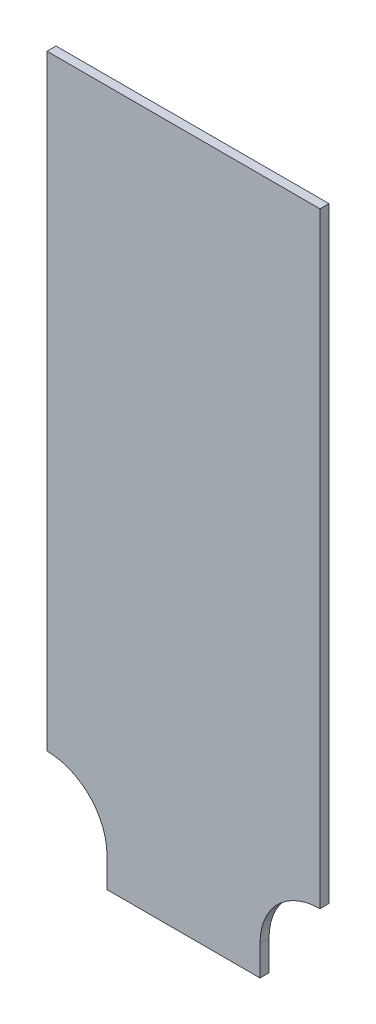
ISO-10303-21;
HEADER;
FILE_DESCRIPTION(('STEP AP214'),'2;1');
FILE_NAME('part.step','',(''),(''),'','','');
FILE_SCHEMA(('AUTOMOTIVE_DESIGN { 1 0 10303 214 1 1 1 1 }'));
ENDSEC;
DATA;
#1=APPLICATION_CONTEXT('core data for automotive mechanical design processes');
#2=APPLICATION_PROTOCOL_DEFINITION('international standard','automotive_design',2000,#1);
#3=PRODUCT_CONTEXT('',#1,'mechanical');
#4=PRODUCT('Part','Part','',(#3));
#5=PRODUCT_RELATED_PRODUCT_CATEGORY('part','',(#4));
#6=PRODUCT_DEFINITION_FORMATION('','',#4);
#7=PRODUCT_DEFINITION_CONTEXT('part definition',#1,'design');
#8=PRODUCT_DEFINITION('design','',#6,#7);
#9=PRODUCT_DEFINITION_SHAPE('','',#8);
#10=(LENGTH_UNIT() NAMED_UNIT(*) SI_UNIT(.MILLI.,.METRE.));
#11=(NAMED_UNIT(*) PLANE_ANGLE_UNIT() SI_UNIT($,.RADIAN.));
#12=(NAMED_UNIT(*) SI_UNIT($,.STERADIAN.) SOLID_ANGLE_UNIT());
#13=UNCERTAINTY_MEASURE_WITH_UNIT(LENGTH_MEASURE(1.E-05),#10,'distance_accuracy_value','');
#14=(GEOMETRIC_REPRESENTATION_CONTEXT(3) GLOBAL_UNCERTAINTY_ASSIGNED_CONTEXT((#13)) GLOBAL_UNIT_ASSIGNED_CONTEXT((#10,
#11,#12)) REPRESENTATION_CONTEXT('',''));
#15=CARTESIAN_POINT('',(0.,0.,0.));
#16=DIRECTION('',(0.,0.,1.));
#17=DIRECTION('',(1.,0.,0.));
#18=AXIS2_PLACEMENT_3D('',#15,#16,#17);
#19=CARTESIAN_POINT('',(-45.5,232.,3.));
#20=DIRECTION('',(1.,0.,0.));
#21=DIRECTION('',(0.,1.,0.));
#22=AXIS2_PLACEMENT_3D('',#19,#20,#21);
#23=PLANE('',#22);
#24=DIRECTION('',(0.,-1.,0.));
#25=VECTOR('',#24,1.);
#26=CARTESIAN_POINT('',(-45.5,232.,0.));
#27=LINE('',#26,#25);
#28=CARTESIAN_POINT('',(-45.5,232.,0.));
#29=VERTEX_POINT('',#28);
#30=CARTESIAN_POINT('',(-45.5,30.,0.));
#31=VERTEX_POINT('',#30);
#32=EDGE_CURVE('E127',#29,#31,#27,.T.);
#33=ORIENTED_EDGE('',*,*,#32,.T.);
#34=DIRECTION('',(0.,0.,-1.));
#35=VECTOR('',#34,1.);
#36=CARTESIAN_POINT('',(-45.5,30.,3.));
#37=LINE('',#36,#35);
#38=CARTESIAN_POINT('',(-45.5,30.,3.));
#39=VERTEX_POINT('',#38);
#40=EDGE_CURVE('E11',#39,#31,#37,.T.);
#41=ORIENTED_EDGE('',*,*,#40,.F.);
#42=DIRECTION('',(0.,-1.,0.));
#43=VECTOR('',#42,1.);
#44=CARTESIAN_POINT('',(-45.5,232.,3.));
#45=LINE('',#44,#43);
#46=CARTESIAN_POINT('',(-45.5,232.,3.));
#47=VERTEX_POINT('',#46);
#48=EDGE_CURVE('E141',#47,#39,#45,.T.);
#49=ORIENTED_EDGE('',*,*,#48,.F.);
#50=DIRECTION('',(0.,0.,-1.));
#51=VECTOR('',#50,1.);
#52=CARTESIAN_POINT('',(-45.5,232.,3.));
#53=LINE('',#52,#51);
#54=EDGE_CURVE('E123',#47,#29,#53,.T.);
#55=ORIENTED_EDGE('',*,*,#54,.T.);
#56=EDGE_LOOP('',(#33,#41,#49,#55));
#57=FACE_BOUND('',#56,.T.);
#58=ADVANCED_FACE('F31',(#57),#23,.F.);
#59=CARTESIAN_POINT('',(-45.5,9.99999999999999,3.));
#60=DIRECTION('',(0.,0.,-1.));
#61=DIRECTION('',(-1.,0.,0.));
#62=AXIS2_PLACEMENT_3D('',#59,#60,#61);
#63=CYLINDRICAL_SURFACE('',#62,20.);
#64=CARTESIAN_POINT('',(-45.5,9.99999999999999,0.));
#65=DIRECTION('',(0.,0.,-1.));
#66=DIRECTION('',(-1.,0.,0.));
#67=AXIS2_PLACEMENT_3D('',#64,#65,#66);
#68=CIRCLE('',#67,20.);
#69=CARTESIAN_POINT('',(-25.5,9.99999999999999,0.));
#70=VERTEX_POINT('',#69);
#71=EDGE_CURVE('E130',#31,#70,#68,.T.);
#72=ORIENTED_EDGE('',*,*,#71,.T.);
#73=DIRECTION('',(0.,0.,-1.));
#74=VECTOR('',#73,1.);
#75=CARTESIAN_POINT('',(-25.5,9.99999999999999,3.));
#76=LINE('',#75,#74);
#77=CARTESIAN_POINT('',(-25.5,9.99999999999999,3.));
#78=VERTEX_POINT('',#77);
#79=EDGE_CURVE('E39',#78,#70,#76,.T.);
#80=ORIENTED_EDGE('',*,*,#79,.F.);
#81=CARTESIAN_POINT('',(-45.5,9.99999999999999,3.));
#82=DIRECTION('',(0.,0.,-1.));
#83=DIRECTION('',(-1.,0.,0.));
#84=AXIS2_PLACEMENT_3D('',#81,#82,#83);
#85=CIRCLE('',#84,20.);
#86=EDGE_CURVE('E90',#39,#78,#85,.T.);
#87=ORIENTED_EDGE('',*,*,#86,.F.);
#88=ORIENTED_EDGE('',*,*,#40,.T.);
#89=EDGE_LOOP('',(#72,#80,#87,#88));
#90=FACE_BOUND('',#89,.T.);
#91=ADVANCED_FACE('F176',(#90),#63,.F.);
#92=CARTESIAN_POINT('',(-25.5,0.,3.));
#93=DIRECTION('',(1.,0.,0.));
#94=DIRECTION('',(0.,0.,-1.));
#95=AXIS2_PLACEMENT_3D('',#92,#93,#94);
#96=PLANE('',#95);
#97=DIRECTION('',(0.,-1.,0.));
#98=VECTOR('',#97,1.);
#99=CARTESIAN_POINT('',(-25.5,0.,0.));
#100=LINE('',#99,#98);
#101=CARTESIAN_POINT('',(-25.5,0.,0.));
#102=VERTEX_POINT('',#101);
#103=EDGE_CURVE('E132',#70,#102,#100,.T.);
#104=ORIENTED_EDGE('',*,*,#103,.T.);
#105=DIRECTION('',(0.,0.,-1.));
#106=VECTOR('',#105,1.);
#107=CARTESIAN_POINT('',(-25.5,0.,3.));
#108=LINE('',#107,#106);
#109=CARTESIAN_POINT('',(-25.5,0.,3.));
#110=VERTEX_POINT('',#109);
#111=EDGE_CURVE('E148',#110,#102,#108,.T.);
#112=ORIENTED_EDGE('',*,*,#111,.F.);
#113=DIRECTION('',(0.,-1.,0.));
#114=VECTOR('',#113,1.);
#115=CARTESIAN_POINT('',(-25.5,0.,3.));
#116=LINE('',#115,#114);
#117=EDGE_CURVE('E156',#78,#110,#116,.T.);
#118=ORIENTED_EDGE('',*,*,#117,.F.);
#119=ORIENTED_EDGE('',*,*,#79,.T.);
#120=EDGE_LOOP('',(#104,#112,#118,#119));
#121=FACE_BOUND('',#120,.T.);
#122=ADVANCED_FACE('F154',(#121),#96,.F.);
#123=CARTESIAN_POINT('',(25.5,0.,3.));
#124=DIRECTION('',(0.,1.,0.));
#125=DIRECTION('',(0.,0.,1.));
#126=AXIS2_PLACEMENT_3D('',#123,#124,#125);
#127=PLANE('',#126);
#128=DIRECTION('',(1.,0.,0.));
#129=VECTOR('',#128,1.);
#130=CARTESIAN_POINT('',(25.5,0.,0.));
#131=LINE('',#130,#129);
#132=CARTESIAN_POINT('',(25.5,0.,0.));
#133=VERTEX_POINT('',#132);
#134=EDGE_CURVE('E134',#102,#133,#131,.T.);
#135=ORIENTED_EDGE('',*,*,#134,.T.);
#136=DIRECTION('',(0.,0.,-1.));
#137=VECTOR('',#136,1.);
#138=CARTESIAN_POINT('',(25.5,0.,3.));
#139=LINE('',#138,#137);
#140=CARTESIAN_POINT('',(25.5,0.,3.));
#141=VERTEX_POINT('',#140);
#142=EDGE_CURVE('E145',#141,#133,#139,.T.);
#143=ORIENTED_EDGE('',*,*,#142,.F.);
#144=DIRECTION('',(1.,0.,0.));
#145=VECTOR('',#144,1.);
#146=CARTESIAN_POINT('',(25.5,0.,3.));
#147=LINE('',#146,#145);
#148=EDGE_CURVE('E168',#110,#141,#147,.T.);
#149=ORIENTED_EDGE('',*,*,#148,.F.);
#150=ORIENTED_EDGE('',*,*,#111,.T.);
#151=EDGE_LOOP('',(#135,#143,#149,#150));
#152=FACE_BOUND('',#151,.T.);
#153=ADVANCED_FACE('F164',(#152),#127,.F.);
#154=CARTESIAN_POINT('',(25.5,0.,3.));
#155=DIRECTION('',(-1.,0.,0.));
#156=DIRECTION('',(0.,0.,1.));
#157=AXIS2_PLACEMENT_3D('',#154,#155,#156);
#158=PLANE('',#157);
#159=DIRECTION('',(0.,1.,0.));
#160=VECTOR('',#159,1.);
#161=CARTESIAN_POINT('',(25.5,0.,0.));
#162=LINE('',#161,#160);
#163=CARTESIAN_POINT('',(25.5,9.99999999999999,0.));
#164=VERTEX_POINT('',#163);
#165=EDGE_CURVE('E136',#133,#164,#162,.T.);
#166=ORIENTED_EDGE('',*,*,#165,.T.);
#167=DIRECTION('',(0.,0.,-1.));
#168=VECTOR('',#167,1.);
#169=CARTESIAN_POINT('',(25.5,9.99999999999999,3.));
#170=LINE('',#169,#168);
#171=CARTESIAN_POINT('',(25.5,9.99999999999999,3.));
#172=VERTEX_POINT('',#171);
#173=EDGE_CURVE('E118',#172,#164,#170,.T.);
#174=ORIENTED_EDGE('',*,*,#173,.F.);
#175=DIRECTION('',(0.,1.,0.));
#176=VECTOR('',#175,1.);
#177=CARTESIAN_POINT('',(25.5,0.,3.));
#178=LINE('',#177,#176);
#179=EDGE_CURVE('E109',#141,#172,#178,.T.);
#180=ORIENTED_EDGE('',*,*,#179,.F.);
#181=ORIENTED_EDGE('',*,*,#142,.T.);
#182=EDGE_LOOP('',(#166,#174,#180,#181));
#183=FACE_BOUND('',#182,.T.);
#184=ADVANCED_FACE('F167',(#183),#158,.F.);
#185=CARTESIAN_POINT('',(45.5,9.99999999999999,3.));
#186=DIRECTION('',(0.,0.,-1.));
#187=DIRECTION('',(-1.,0.,0.));
#188=AXIS2_PLACEMENT_3D('',#185,#186,#187);
#189=CYLINDRICAL_SURFACE('',#188,20.);
#190=CARTESIAN_POINT('',(45.5,9.99999999999999,0.));
#191=DIRECTION('',(0.,0.,-1.));
#192=DIRECTION('',(1.,0.,0.));
#193=AXIS2_PLACEMENT_3D('',#190,#191,#192);
#194=CIRCLE('',#193,20.);
#195=CARTESIAN_POINT('',(45.5,30.,0.));
#196=VERTEX_POINT('',#195);
#197=EDGE_CURVE('E117',#164,#196,#194,.T.);
#198=ORIENTED_EDGE('',*,*,#197,.T.);
#199=DIRECTION('',(0.,0.,-1.));
#200=VECTOR('',#199,1.);
#201=CARTESIAN_POINT('',(45.5,30.,3.));
#202=LINE('',#201,#200);
#203=CARTESIAN_POINT('',(45.5,30.,3.));
#204=VERTEX_POINT('',#203);
#205=EDGE_CURVE('E114',#204,#196,#202,.T.);
#206=ORIENTED_EDGE('',*,*,#205,.F.);
#207=CARTESIAN_POINT('',(45.5,9.99999999999999,3.));
#208=DIRECTION('',(0.,0.,-1.));
#209=DIRECTION('',(1.,0.,0.));
#210=AXIS2_PLACEMENT_3D('',#207,#208,#209);
#211=CIRCLE('',#210,20.);
#212=EDGE_CURVE('E103',#172,#204,#211,.T.);
#213=ORIENTED_EDGE('',*,*,#212,.F.);
#214=ORIENTED_EDGE('',*,*,#173,.T.);
#215=EDGE_LOOP('',(#198,#206,#213,#214));
#216=FACE_BOUND('',#215,.T.);
#217=ADVANCED_FACE('F115',(#216),#189,.F.);
#218=CARTESIAN_POINT('',(45.5,232.,3.));
#219=DIRECTION('',(-1.,0.,0.));
#220=DIRECTION('',(0.,-1.,0.));
#221=AXIS2_PLACEMENT_3D('',#218,#219,#220);
#222=PLANE('',#221);
#223=DIRECTION('',(0.,1.,0.));
#224=VECTOR('',#223,1.);
#225=CARTESIAN_POINT('',(45.5,232.,0.));
#226=LINE('',#225,#224);
#227=CARTESIAN_POINT('',(45.5,232.,0.));
#228=VERTEX_POINT('',#227);
#229=EDGE_CURVE('E76',#196,#228,#226,.T.);
#230=ORIENTED_EDGE('',*,*,#229,.T.);
#231=DIRECTION('',(0.,0.,-1.));
#232=VECTOR('',#231,1.);
#233=CARTESIAN_POINT('',(45.5,232.,3.));
#234=LINE('',#233,#232);
#235=CARTESIAN_POINT('',(45.5,232.,3.));
#236=VERTEX_POINT('',#235);
#237=EDGE_CURVE('E119',#236,#228,#234,.T.);
#238=ORIENTED_EDGE('',*,*,#237,.F.);
#239=DIRECTION('',(0.,1.,0.));
#240=VECTOR('',#239,1.);
#241=CARTESIAN_POINT('',(45.5,232.,3.));
#242=LINE('',#241,#240);
#243=EDGE_CURVE('E107',#204,#236,#242,.T.);
#244=ORIENTED_EDGE('',*,*,#243,.F.);
#245=ORIENTED_EDGE('',*,*,#205,.T.);
#246=EDGE_LOOP('',(#230,#238,#244,#245));
#247=FACE_BOUND('',#246,.T.);
#248=ADVANCED_FACE('F121',(#247),#222,.F.);
#249=CARTESIAN_POINT('',(45.5,232.,3.));
#250=DIRECTION('',(0.,-1.,0.));
#251=DIRECTION('',(0.,0.,-1.));
#252=AXIS2_PLACEMENT_3D('',#249,#250,#251);
#253=PLANE('',#252);
#254=DIRECTION('',(-1.,0.,0.));
#255=VECTOR('',#254,1.);
#256=CARTESIAN_POINT('',(45.5,232.,0.));
#257=LINE('',#256,#255);
#258=EDGE_CURVE('E82',#228,#29,#257,.T.);
#259=ORIENTED_EDGE('',*,*,#258,.T.);
#260=ORIENTED_EDGE('',*,*,#54,.F.);
#261=DIRECTION('',(-1.,0.,0.));
#262=VECTOR('',#261,1.);
#263=CARTESIAN_POINT('',(45.5,232.,3.));
#264=LINE('',#263,#262);
#265=EDGE_CURVE('E47',#236,#47,#264,.T.);
#266=ORIENTED_EDGE('',*,*,#265,.F.);
#267=ORIENTED_EDGE('',*,*,#237,.T.);
#268=EDGE_LOOP('',(#259,#260,#266,#267));
#269=FACE_BOUND('',#268,.T.);
#270=ADVANCED_FACE('F192',(#269),#253,.F.);
#271=CARTESIAN_POINT('',(-45.5,9.99999999999999,3.));
#272=DIRECTION('',(0.,0.,-1.));
#273=DIRECTION('',(-1.,0.,0.));
#274=AXIS2_PLACEMENT_3D('',#271,#272,#273);
#275=PLANE('',#274);
#276=ORIENTED_EDGE('',*,*,#48,.T.);
#277=ORIENTED_EDGE('',*,*,#86,.T.);
#278=ORIENTED_EDGE('',*,*,#117,.T.);
#279=ORIENTED_EDGE('',*,*,#148,.T.);
#280=ORIENTED_EDGE('',*,*,#179,.T.);
#281=ORIENTED_EDGE('',*,*,#212,.T.);
#282=ORIENTED_EDGE('',*,*,#243,.T.);
#283=ORIENTED_EDGE('',*,*,#265,.T.);
#284=EDGE_LOOP('',(#276,#277,#278,#279,#280,#281,#282,#283));
#285=FACE_BOUND('',#284,.T.);
#286=ADVANCED_FACE('F105',(#285),#275,.F.);
#287=CARTESIAN_POINT('',(-45.5,9.99999999999999,0.));
#288=DIRECTION('',(0.,0.,-1.));
#289=DIRECTION('',(-1.,0.,0.));
#290=AXIS2_PLACEMENT_3D('',#287,#288,#289);
#291=PLANE('',#290);
#292=ORIENTED_EDGE('',*,*,#32,.F.);
#293=ORIENTED_EDGE('',*,*,#258,.F.);
#294=ORIENTED_EDGE('',*,*,#229,.F.);
#295=ORIENTED_EDGE('',*,*,#197,.F.);
#296=ORIENTED_EDGE('',*,*,#165,.F.);
#297=ORIENTED_EDGE('',*,*,#134,.F.);
#298=ORIENTED_EDGE('',*,*,#103,.F.);
#299=ORIENTED_EDGE('',*,*,#71,.F.);
#300=EDGE_LOOP('',(#292,#293,#294,#295,#296,#297,#298,#299));
#301=FACE_BOUND('',#300,.T.);
#302=ADVANCED_FACE('F160',(#301),#291,.T.);
#303=CLOSED_SHELL('',(#58,#91,#122,#153,#184,#217,#248,#270,#286,#302));
#304=MANIFOLD_SOLID_BREP('B2',#303);
#305=ADVANCED_BREP_SHAPE_REPRESENTATION('',(#18,#304),#14);
#306=SHAPE_DEFINITION_REPRESENTATION(#9,#305);
ENDSEC;
END-ISO-10303-21;
